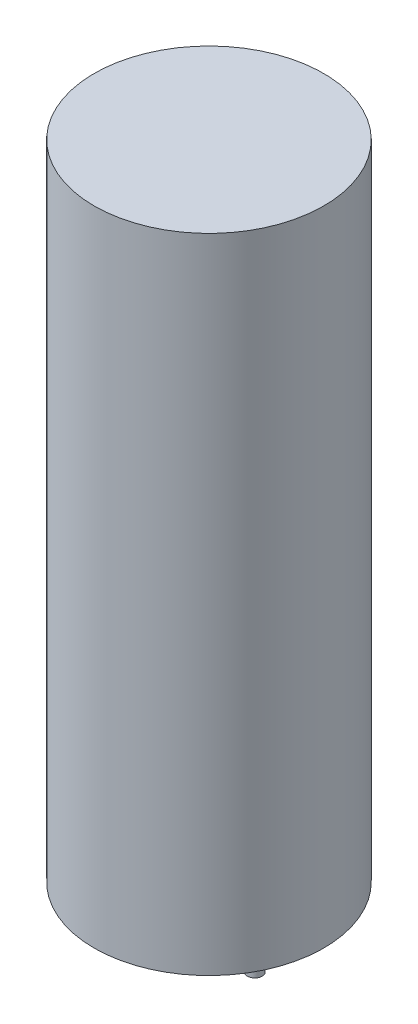
ISO-10303-21;
HEADER;
FILE_DESCRIPTION(('STEP AP214'),'2;1');
FILE_NAME('part.step','',(''),(''),'','','');
FILE_SCHEMA(('AUTOMOTIVE_DESIGN { 1 0 10303 214 1 1 1 1 }'));
ENDSEC;
DATA;
#1=APPLICATION_CONTEXT('core data for automotive mechanical design processes');
#2=APPLICATION_PROTOCOL_DEFINITION('international standard','automotive_design',2000,#1);
#3=PRODUCT_CONTEXT('',#1,'mechanical');
#4=PRODUCT('Part','Part','',(#3));
#5=PRODUCT_RELATED_PRODUCT_CATEGORY('part','',(#4));
#6=PRODUCT_DEFINITION_FORMATION('','',#4);
#7=PRODUCT_DEFINITION_CONTEXT('part definition',#1,'design');
#8=PRODUCT_DEFINITION('design','',#6,#7);
#9=PRODUCT_DEFINITION_SHAPE('','',#8);
#10=(LENGTH_UNIT() NAMED_UNIT(*) SI_UNIT(.MILLI.,.METRE.));
#11=(NAMED_UNIT(*) PLANE_ANGLE_UNIT() SI_UNIT($,.RADIAN.));
#12=(NAMED_UNIT(*) SI_UNIT($,.STERADIAN.) SOLID_ANGLE_UNIT());
#13=UNCERTAINTY_MEASURE_WITH_UNIT(LENGTH_MEASURE(1.E-05),#10,'distance_accuracy_value','');
#14=(GEOMETRIC_REPRESENTATION_CONTEXT(3) GLOBAL_UNCERTAINTY_ASSIGNED_CONTEXT((#13)) GLOBAL_UNIT_ASSIGNED_CONTEXT((#10,
#11,#12)) REPRESENTATION_CONTEXT('',''));
#15=CARTESIAN_POINT('',(0.,0.,0.));
#16=DIRECTION('',(0.,0.,1.));
#17=DIRECTION('',(1.,0.,0.));
#18=AXIS2_PLACEMENT_3D('',#15,#16,#17);
#19=CARTESIAN_POINT('',(-2.5,-3.,0.));
#20=DIRECTION('',(0.,1.,0.));
#21=DIRECTION('',(0.,0.,1.));
#22=AXIS2_PLACEMENT_3D('',#19,#20,#21);
#23=CYLINDRICAL_SURFACE('',#22,0.4);
#24=CARTESIAN_POINT('',(-2.5,-3.,0.));
#25=DIRECTION('',(0.,1.,0.));
#26=DIRECTION('',(0.,0.,1.));
#27=AXIS2_PLACEMENT_3D('',#24,#25,#26);
#28=CIRCLE('',#27,0.4);
#29=CARTESIAN_POINT('',(-2.5,-3.,0.4));
#30=VERTEX_POINT('',#29);
#31=EDGE_CURVE('E10',#30,#30,#28,.T.);
#32=ORIENTED_EDGE('',*,*,#31,.T.);
#33=EDGE_LOOP('',(#32));
#34=FACE_BOUND('',#33,.T.);
#35=CARTESIAN_POINT('',(-2.5,0.,0.));
#36=DIRECTION('',(0.,1.,0.));
#37=DIRECTION('',(0.,0.,1.));
#38=AXIS2_PLACEMENT_3D('',#35,#36,#37);
#39=CIRCLE('',#38,0.4);
#40=CARTESIAN_POINT('',(-2.5,0.,0.4));
#41=VERTEX_POINT('',#40);
#42=EDGE_CURVE('E50',#41,#41,#39,.T.);
#43=ORIENTED_EDGE('',*,*,#42,.F.);
#44=EDGE_LOOP('',(#43));
#45=FACE_BOUND('',#44,.T.);
#46=ADVANCED_FACE('F47',(#34,#45),#23,.T.);
#47=CARTESIAN_POINT('',(-2.5,-3.,0.));
#48=DIRECTION('',(0.,1.,0.));
#49=DIRECTION('',(0.,0.,1.));
#50=AXIS2_PLACEMENT_3D('',#47,#48,#49);
#51=PLANE('',#50);
#52=ORIENTED_EDGE('',*,*,#31,.F.);
#53=EDGE_LOOP('',(#52));
#54=FACE_BOUND('',#53,.T.);
#55=ADVANCED_FACE('F89',(#54),#51,.F.);
#56=CARTESIAN_POINT('',(0.,35.,0.));
#57=DIRECTION('',(0.,-1.,0.));
#58=DIRECTION('',(0.,0.,-1.));
#59=AXIS2_PLACEMENT_3D('',#56,#57,#58);
#60=CYLINDRICAL_SURFACE('',#59,6.25);
#61=CARTESIAN_POINT('',(0.,35.,0.));
#62=DIRECTION('',(0.,1.,0.));
#63=DIRECTION('',(0.,0.,1.));
#64=AXIS2_PLACEMENT_3D('',#61,#62,#63);
#65=CIRCLE('',#64,6.25);
#66=CARTESIAN_POINT('',(0.,35.,6.25));
#67=VERTEX_POINT('',#66);
#68=EDGE_CURVE('E59',#67,#67,#65,.T.);
#69=ORIENTED_EDGE('',*,*,#68,.F.);
#70=EDGE_LOOP('',(#69));
#71=FACE_BOUND('',#70,.T.);
#72=CARTESIAN_POINT('',(0.,0.,0.));
#73=DIRECTION('',(0.,1.,0.));
#74=DIRECTION('',(0.,0.,1.));
#75=AXIS2_PLACEMENT_3D('',#72,#73,#74);
#76=CIRCLE('',#75,6.25);
#77=CARTESIAN_POINT('',(0.,0.,6.25));
#78=VERTEX_POINT('',#77);
#79=EDGE_CURVE('E61',#78,#78,#76,.T.);
#80=ORIENTED_EDGE('',*,*,#79,.T.);
#81=EDGE_LOOP('',(#80));
#82=FACE_BOUND('',#81,.T.);
#83=ADVANCED_FACE('F93',(#71,#82),#60,.T.);
#84=CARTESIAN_POINT('',(0.,35.,0.));
#85=DIRECTION('',(0.,1.,0.));
#86=DIRECTION('',(0.,0.,1.));
#87=AXIS2_PLACEMENT_3D('',#84,#85,#86);
#88=PLANE('',#87);
#89=ORIENTED_EDGE('',*,*,#68,.T.);
#90=EDGE_LOOP('',(#89));
#91=FACE_BOUND('',#90,.T.);
#92=ADVANCED_FACE('F100',(#91),#88,.T.);
#93=CARTESIAN_POINT('',(0.,0.,0.));
#94=DIRECTION('',(0.,1.,0.));
#95=DIRECTION('',(0.,0.,1.));
#96=AXIS2_PLACEMENT_3D('',#93,#94,#95);
#97=PLANE('',#96);
#98=CARTESIAN_POINT('',(2.5,0.,0.));
#99=DIRECTION('',(0.,1.,0.));
#100=DIRECTION('',(0.,0.,1.));
#101=AXIS2_PLACEMENT_3D('',#98,#99,#100);
#102=CIRCLE('',#101,0.4);
#103=CARTESIAN_POINT('',(2.5,0.,0.4));
#104=VERTEX_POINT('',#103);
#105=EDGE_CURVE('E69',#104,#104,#102,.T.);
#106=ORIENTED_EDGE('',*,*,#105,.T.);
#107=EDGE_LOOP('',(#106));
#108=FACE_BOUND('',#107,.T.);
#109=ORIENTED_EDGE('',*,*,#42,.T.);
#110=EDGE_LOOP('',(#109));
#111=FACE_BOUND('',#110,.T.);
#112=ORIENTED_EDGE('',*,*,#79,.F.);
#113=EDGE_LOOP('',(#112));
#114=FACE_BOUND('',#113,.T.);
#115=ADVANCED_FACE('F86',(#108,#111,#114),#97,.F.);
#116=CARTESIAN_POINT('',(2.5,-3.,0.));
#117=DIRECTION('',(0.,1.,0.));
#118=DIRECTION('',(0.,0.,1.));
#119=AXIS2_PLACEMENT_3D('',#116,#117,#118);
#120=CYLINDRICAL_SURFACE('',#119,0.4);
#121=CARTESIAN_POINT('',(2.5,-3.,0.));
#122=DIRECTION('',(0.,1.,0.));
#123=DIRECTION('',(0.,0.,1.));
#124=AXIS2_PLACEMENT_3D('',#121,#122,#123);
#125=CIRCLE('',#124,0.4);
#126=CARTESIAN_POINT('',(2.5,-3.,0.4));
#127=VERTEX_POINT('',#126);
#128=EDGE_CURVE('E65',#127,#127,#125,.T.);
#129=ORIENTED_EDGE('',*,*,#128,.T.);
#130=EDGE_LOOP('',(#129));
#131=FACE_BOUND('',#130,.T.);
#132=ORIENTED_EDGE('',*,*,#105,.F.);
#133=EDGE_LOOP('',(#132));
#134=FACE_BOUND('',#133,.T.);
#135=ADVANCED_FACE('F77',(#131,#134),#120,.T.);
#136=CARTESIAN_POINT('',(2.5,-3.,0.));
#137=DIRECTION('',(0.,1.,0.));
#138=DIRECTION('',(0.,0.,1.));
#139=AXIS2_PLACEMENT_3D('',#136,#137,#138);
#140=PLANE('',#139);
#141=ORIENTED_EDGE('',*,*,#128,.F.);
#142=EDGE_LOOP('',(#141));
#143=FACE_BOUND('',#142,.T.);
#144=ADVANCED_FACE('F80',(#143),#140,.F.);
#145=CLOSED_SHELL('',(#46,#55,#83,#92,#115,#135,#144));
#146=MANIFOLD_SOLID_BREP('B2',#145);
#147=ADVANCED_BREP_SHAPE_REPRESENTATION('',(#18,#146),#14);
#148=SHAPE_DEFINITION_REPRESENTATION(#9,#147);
ENDSEC;
END-ISO-10303-21;
